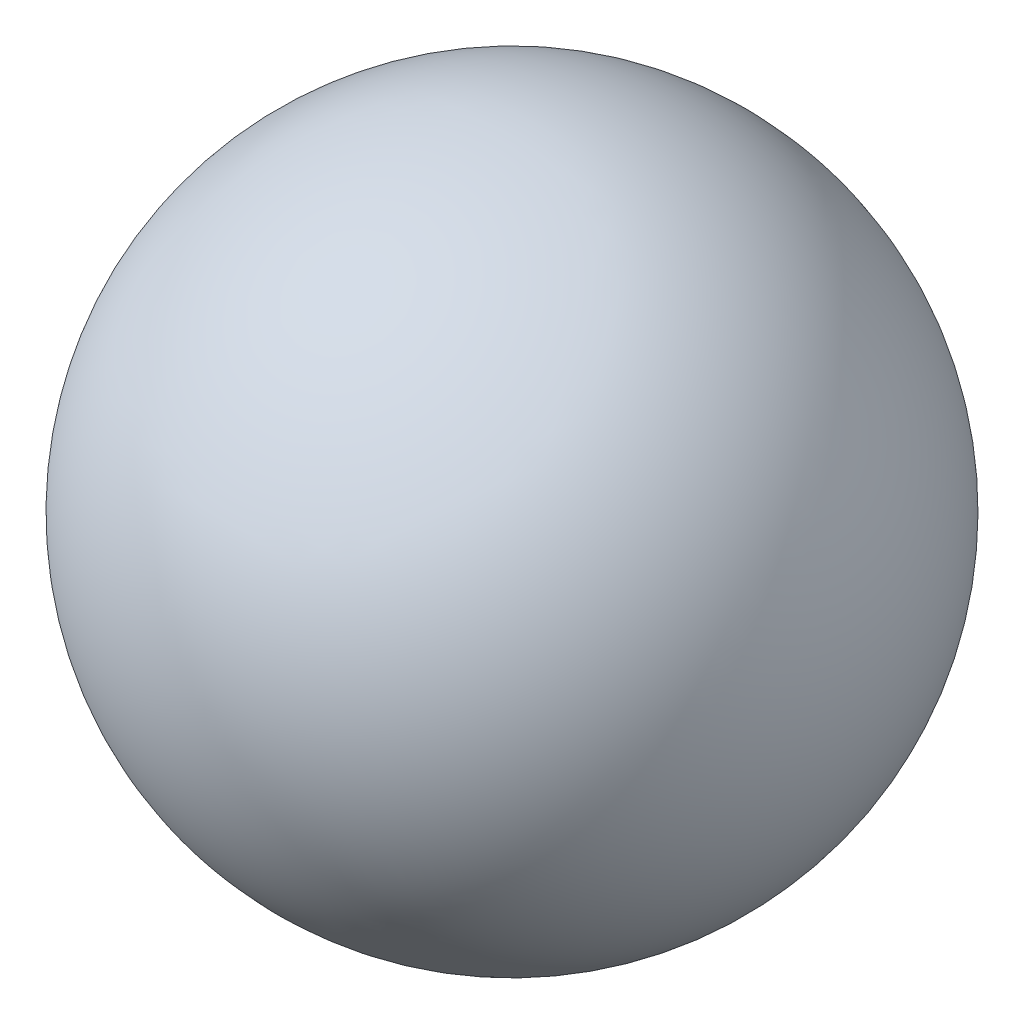
ISO-10303-21;
HEADER;
FILE_DESCRIPTION(('STEP AP214'),'2;1');
FILE_NAME('part.step','',(''),(''),'','','');
FILE_SCHEMA(('AUTOMOTIVE_DESIGN { 1 0 10303 214 1 1 1 1 }'));
ENDSEC;
DATA;
#1=APPLICATION_CONTEXT('core data for automotive mechanical design processes');
#2=APPLICATION_PROTOCOL_DEFINITION('international standard','automotive_design',2000,#1);
#3=PRODUCT_CONTEXT('',#1,'mechanical');
#4=PRODUCT('Part','Part','',(#3));
#5=PRODUCT_RELATED_PRODUCT_CATEGORY('part','',(#4));
#6=PRODUCT_DEFINITION_FORMATION('','',#4);
#7=PRODUCT_DEFINITION_CONTEXT('part definition',#1,'design');
#8=PRODUCT_DEFINITION('design','',#6,#7);
#9=PRODUCT_DEFINITION_SHAPE('','',#8);
#10=(LENGTH_UNIT() NAMED_UNIT(*) SI_UNIT(.MILLI.,.METRE.));
#11=(NAMED_UNIT(*) PLANE_ANGLE_UNIT() SI_UNIT($,.RADIAN.));
#12=(NAMED_UNIT(*) SI_UNIT($,.STERADIAN.) SOLID_ANGLE_UNIT());
#13=UNCERTAINTY_MEASURE_WITH_UNIT(LENGTH_MEASURE(1.E-05),#10,'distance_accuracy_value','');
#14=(GEOMETRIC_REPRESENTATION_CONTEXT(3) GLOBAL_UNCERTAINTY_ASSIGNED_CONTEXT((#13)) GLOBAL_UNIT_ASSIGNED_CONTEXT((#10,
#11,#12)) REPRESENTATION_CONTEXT('',''));
#15=CARTESIAN_POINT('',(0.,0.,0.));
#16=DIRECTION('',(0.,0.,1.));
#17=DIRECTION('',(1.,0.,0.));
#18=AXIS2_PLACEMENT_3D('',#15,#16,#17);
#19=CARTESIAN_POINT('',(49.75,-21.5384666425886,48.4256280799341));
#20=DIRECTION('',(0.,-0.406389996935606,0.91369971565645));
#21=DIRECTION('',(0.173648177666933,-0.899818563903522,-0.400216019728792));
#22=AXIS2_PLACEMENT_3D('',#19,#20,#21);
#23=SPHERICAL_SURFACE('',#22,5.95);
#24=CARTESIAN_POINT('',(49.75,-19.1204461608217,42.9891147717782));
#25=VERTEX_POINT('',#24);
#26=VERTEX_LOOP('',#25);
#27=FACE_BOUND('',#26,.T.);
#28=CARTESIAN_POINT('',(49.75,-23.9564871243555,53.86214138809));
#29=VERTEX_POINT('',#28);
#30=VERTEX_LOOP('',#29);
#31=FACE_BOUND('',#30,.T.);
#32=ADVANCED_FACE('F16',(#27,#31),#23,.T.);
#33=CLOSED_SHELL('',(#32));
#34=MANIFOLD_SOLID_BREP('B1',#33);
#35=ADVANCED_BREP_SHAPE_REPRESENTATION('',(#18,#34),#14);
#36=SHAPE_DEFINITION_REPRESENTATION(#9,#35);
ENDSEC;
END-ISO-10303-21;
